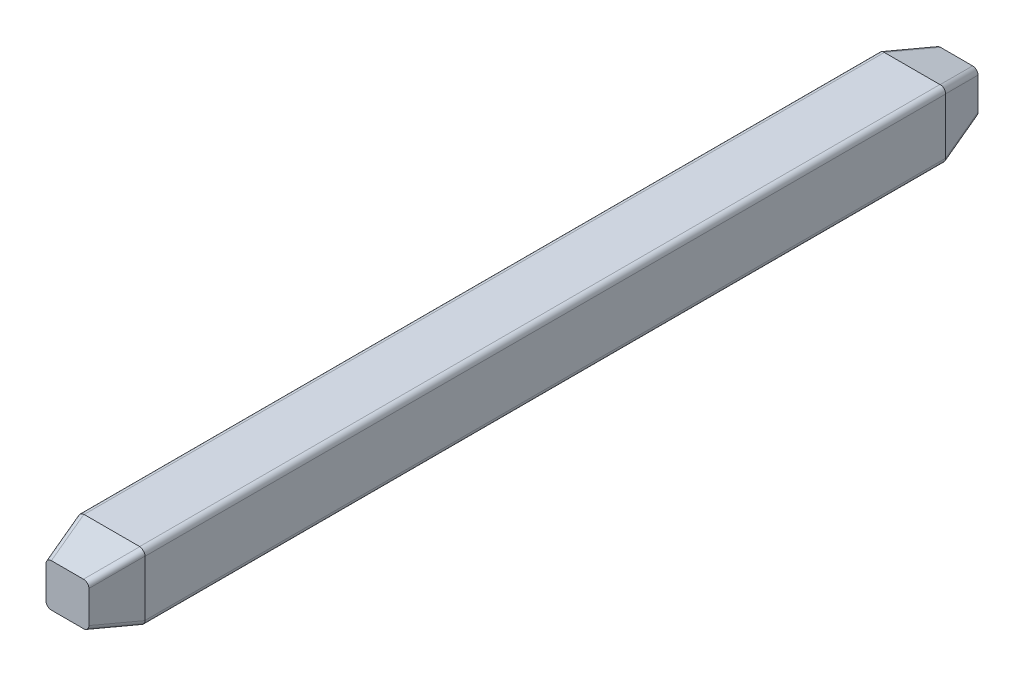
ISO-10303-21;
HEADER;
FILE_DESCRIPTION(('STEP AP214'),'2;1');
FILE_NAME('part.step','',(''),(''),'','','');
FILE_SCHEMA(('AUTOMOTIVE_DESIGN { 1 0 10303 214 1 1 1 1 }'));
ENDSEC;
DATA;
#1=APPLICATION_CONTEXT('core data for automotive mechanical design processes');
#2=APPLICATION_PROTOCOL_DEFINITION('international standard','automotive_design',2000,#1);
#3=PRODUCT_CONTEXT('',#1,'mechanical');
#4=PRODUCT('Part','Part','',(#3));
#5=PRODUCT_RELATED_PRODUCT_CATEGORY('part','',(#4));
#6=PRODUCT_DEFINITION_FORMATION('','',#4);
#7=PRODUCT_DEFINITION_CONTEXT('part definition',#1,'design');
#8=PRODUCT_DEFINITION('design','',#6,#7);
#9=PRODUCT_DEFINITION_SHAPE('','',#8);
#10=(LENGTH_UNIT() NAMED_UNIT(*) SI_UNIT(.MILLI.,.METRE.));
#11=(NAMED_UNIT(*) PLANE_ANGLE_UNIT() SI_UNIT($,.RADIAN.));
#12=(NAMED_UNIT(*) SI_UNIT($,.STERADIAN.) SOLID_ANGLE_UNIT());
#13=UNCERTAINTY_MEASURE_WITH_UNIT(LENGTH_MEASURE(1.E-05),#10,'distance_accuracy_value','');
#14=(GEOMETRIC_REPRESENTATION_CONTEXT(3) GLOBAL_UNCERTAINTY_ASSIGNED_CONTEXT((#13)) GLOBAL_UNIT_ASSIGNED_CONTEXT((#10,
#11,#12)) REPRESENTATION_CONTEXT('',''));
#15=CARTESIAN_POINT('',(0.,0.,0.));
#16=DIRECTION('',(0.,0.,1.));
#17=DIRECTION('',(1.,0.,0.));
#18=AXIS2_PLACEMENT_3D('',#15,#16,#17);
#19=CARTESIAN_POINT('',(-0.3,0.3,-3.));
#20=DIRECTION('',(-1.,0.,0.));
#21=DIRECTION('',(0.,1.,0.));
#22=AXIS2_PLACEMENT_3D('',#19,#20,#21);
#23=PLANE('',#22);
#24=DIRECTION('',(0.,1.,0.));
#25=VECTOR('',#24,1.);
#26=CARTESIAN_POINT('',(-0.300000000001,0.,4.6));
#27=LINE('',#26,#25);
#28=CARTESIAN_POINT('',(-0.3,-0.25,4.6));
#29=VERTEX_POINT('',#28);
#30=CARTESIAN_POINT('',(-0.3,0.25,4.6));
#31=VERTEX_POINT('',#30);
#32=EDGE_CURVE('E509',#29,#31,#27,.T.);
#33=ORIENTED_EDGE('',*,*,#32,.T.);
#34=DIRECTION('',(0.,0.,1.));
#35=VECTOR('',#34,1.);
#36=CARTESIAN_POINT('',(-0.3,0.25,-3.));
#37=LINE('',#36,#35);
#38=CARTESIAN_POINT('',(-0.3,0.25,-2.6));
#39=VERTEX_POINT('',#38);
#40=EDGE_CURVE('E26',#39,#31,#37,.T.);
#41=ORIENTED_EDGE('',*,*,#40,.F.);
#42=DIRECTION('',(0.,1.,0.));
#43=VECTOR('',#42,1.);
#44=CARTESIAN_POINT('',(-0.3,0.3,-2.6));
#45=LINE('',#44,#43);
#46=CARTESIAN_POINT('',(-0.3,-0.25,-2.6));
#47=VERTEX_POINT('',#46);
#48=EDGE_CURVE('E11',#47,#39,#45,.T.);
#49=ORIENTED_EDGE('',*,*,#48,.F.);
#50=DIRECTION('',(0.,0.,-1.));
#51=VECTOR('',#50,1.);
#52=CARTESIAN_POINT('',(-0.3,-0.25,-3.));
#53=LINE('',#52,#51);
#54=EDGE_CURVE('E386',#29,#47,#53,.T.);
#55=ORIENTED_EDGE('',*,*,#54,.F.);
#56=EDGE_LOOP('',(#33,#41,#49,#55));
#57=FACE_BOUND('',#56,.T.);
#58=ADVANCED_FACE('F17',(#57),#23,.T.);
#59=CARTESIAN_POINT('',(-0.3,0.3,-2.6));
#60=DIRECTION('',(-0.965925826288944,0.,-0.258819045102985));
#61=DIRECTION('',(-0.258819045102985,0.,0.965925826288944));
#62=AXIS2_PLACEMENT_3D('',#59,#60,#61);
#63=PLANE('',#62);
#64=DIRECTION('',(-0.250562807085973,0.250562807085973,0.9351131265309));
#65=VECTOR('',#64,1.);
#66=CARTESIAN_POINT('',(-0.303032124252,0.254735832938,-2.588683958234));
#67=LINE('',#66,#65);
#68=CARTESIAN_POINT('',(-0.192820323027,0.144524031713,-3.));
#69=VERTEX_POINT('',#68);
#70=CARTESIAN_POINT('',(-0.299971914966,0.251675623652,-2.600104814773));
#71=VERTEX_POINT('',#70);
#72=EDGE_CURVE('E469',#69,#71,#67,.T.);
#73=ORIENTED_EDGE('',*,*,#72,.F.);
#74=DIRECTION('',(0.,-1.,0.));
#75=VECTOR('',#74,1.);
#76=CARTESIAN_POINT('',(-0.192820323028,0.,-3.));
#77=LINE('',#76,#75);
#78=CARTESIAN_POINT('',(-0.192820323027,-0.144524031713,-3.));
#79=VERTEX_POINT('',#78);
#80=EDGE_CURVE('E460',#69,#79,#77,.T.);
#81=ORIENTED_EDGE('',*,*,#80,.T.);
#82=DIRECTION('',(0.250562807085973,0.250562807085973,-0.9351131265309));
#83=VECTOR('',#82,1.);
#84=CARTESIAN_POINT('',(-0.265363092075,-0.217066800762,-2.72926670019));
#85=LINE('',#84,#83);
#86=CARTESIAN_POINT('',(-0.299971914966,-0.251675623652,-2.600104814773));
#87=VERTEX_POINT('',#86);
#88=EDGE_CURVE('E270',#87,#79,#85,.T.);
#89=ORIENTED_EDGE('',*,*,#88,.F.);
#90=CARTESIAN_POINT('',(-0.3,-0.25,-2.6));
#91=CARTESIAN_POINT('',(-0.3,-0.250558593509,-2.6));
#92=CARTESIAN_POINT('',(-0.299990638322,-0.251117239345,-2.600034938258));
#93=CARTESIAN_POINT('',(-0.299971914966,-0.251675623652,-2.600104814773));
#94=(BOUNDED_CURVE() B_SPLINE_CURVE(3,(#90,#91,#92,#93),.UNSPECIFIED.,.F.,
.F.) B_SPLINE_CURVE_WITH_KNOTS((4,4),(0.,1.),
.UNSPECIFIED.) CURVE() GEOMETRIC_REPRESENTATION_ITEM() RATIONAL_B_SPLINE_CURVE((1.,1.,1.,1.)) REPRESENTATION_ITEM(''));
#95=EDGE_CURVE('E496',#47,#87,#94,.T.);
#96=ORIENTED_EDGE('',*,*,#95,.F.);
#97=ORIENTED_EDGE('',*,*,#48,.T.);
#98=CARTESIAN_POINT('',(-0.299971914966,0.251675623652,-2.600104814773));
#99=CARTESIAN_POINT('',(-0.299990638322,0.251117239345,-2.600034938258));
#100=CARTESIAN_POINT('',(-0.3,0.250558593509,-2.6));
#101=CARTESIAN_POINT('',(-0.3,0.25,-2.6));
#102=(BOUNDED_CURVE() B_SPLINE_CURVE(3,(#98,#99,#100,#101),.UNSPECIFIED.,.F.,
.F.) B_SPLINE_CURVE_WITH_KNOTS((4,4),(0.,1.),
.UNSPECIFIED.) CURVE() GEOMETRIC_REPRESENTATION_ITEM() RATIONAL_B_SPLINE_CURVE((1.,1.,1.,1.)) REPRESENTATION_ITEM(''));
#103=EDGE_CURVE('E43',#71,#39,#102,.T.);
#104=ORIENTED_EDGE('',*,*,#103,.F.);
#105=EDGE_LOOP('',(#73,#81,#89,#96,#97,#104));
#106=FACE_BOUND('',#105,.T.);
#107=ADVANCED_FACE('F19',(#106),#63,.T.);
#108=CARTESIAN_POINT('',(-0.25,0.25,-3.));
#109=DIRECTION('',(0.,0.,1.));
#110=DIRECTION('',(1.,0.,0.));
#111=AXIS2_PLACEMENT_3D('',#108,#109,#110);
#112=CYLINDRICAL_SURFACE('',#111,0.05);
#113=CARTESIAN_POINT('',(-0.299971914966,0.251675623652,-2.600104814773));
#114=CARTESIAN_POINT('',(-0.299041757135,0.279415604526,-2.603576211058));
#115=CARTESIAN_POINT('',(-0.279415604526,0.299041757135,-2.603576211058));
#116=CARTESIAN_POINT('',(-0.251675623652,0.299971914966,-2.600104814773));
#117=(BOUNDED_CURVE() B_SPLINE_CURVE(3,(#113,#114,#115,#116),.UNSPECIFIED.,.F.,
.F.) B_SPLINE_CURVE_WITH_KNOTS((4,4),(5.531305892891,7.035064721466),
.UNSPECIFIED.) CURVE() GEOMETRIC_REPRESENTATION_ITEM() RATIONAL_B_SPLINE_CURVE((1.,
0.820270997179,0.820270997179,1.)) REPRESENTATION_ITEM(''));
#118=CARTESIAN_POINT('',(-0.251675623652,0.299971914966,-2.600104814773));
#119=VERTEX_POINT('',#118);
#120=EDGE_CURVE('E461',#71,#119,#117,.T.);
#121=ORIENTED_EDGE('',*,*,#120,.F.);
#122=ORIENTED_EDGE('',*,*,#103,.T.);
#123=ORIENTED_EDGE('',*,*,#40,.T.);
#124=CARTESIAN_POINT('',(-0.3,0.25,4.6));
#125=CARTESIAN_POINT('',(-0.3,0.250558593509,4.6));
#126=CARTESIAN_POINT('',(-0.299990638322,0.251117239345,4.600034938258));
#127=CARTESIAN_POINT('',(-0.299971914966,0.251675623652,4.600104814773));
#128=(BOUNDED_CURVE() B_SPLINE_CURVE(3,(#124,#125,#126,#127),.UNSPECIFIED.,.F.,
.F.) B_SPLINE_CURVE_WITH_KNOTS((4,4),(0.,1.),
.UNSPECIFIED.) CURVE() GEOMETRIC_REPRESENTATION_ITEM() RATIONAL_B_SPLINE_CURVE((1.,1.,1.,1.)) REPRESENTATION_ITEM(''));
#129=CARTESIAN_POINT('',(-0.299971914966,0.251675623652,4.600104814773));
#130=VERTEX_POINT('',#129);
#131=EDGE_CURVE('E518',#31,#130,#128,.T.);
#132=ORIENTED_EDGE('',*,*,#131,.T.);
#133=CARTESIAN_POINT('',(-0.251675623652,0.299971914966,4.600104814773));
#134=CARTESIAN_POINT('',(-0.279415604526,0.299041757135,4.603576211058));
#135=CARTESIAN_POINT('',(-0.299041757135,0.279415604526,4.603576211058));
#136=CARTESIAN_POINT('',(-0.299971914966,0.251675623652,4.600104814773));
#137=(BOUNDED_CURVE() B_SPLINE_CURVE(3,(#133,#134,#135,#136),.UNSPECIFIED.,.F.,
.F.) B_SPLINE_CURVE_WITH_KNOTS((4,4),(5.531305892893,7.035064721466),
.UNSPECIFIED.) CURVE() GEOMETRIC_REPRESENTATION_ITEM() RATIONAL_B_SPLINE_CURVE((1.,
0.82027099718,0.82027099718,1.)) REPRESENTATION_ITEM(''));
#138=CARTESIAN_POINT('',(-0.251675623652,0.299971914966,4.600104814773));
#139=VERTEX_POINT('',#138);
#140=EDGE_CURVE('E470',#139,#130,#137,.T.);
#141=ORIENTED_EDGE('',*,*,#140,.F.);
#142=CARTESIAN_POINT('',(-0.251675623652,0.299971914966,4.600104814773));
#143=CARTESIAN_POINT('',(-0.251117239345,0.299990638322,4.600034938258));
#144=CARTESIAN_POINT('',(-0.250558593509,0.3,4.6));
#145=CARTESIAN_POINT('',(-0.25,0.3,4.6));
#146=(BOUNDED_CURVE() B_SPLINE_CURVE(3,(#142,#143,#144,#145),.UNSPECIFIED.,.F.,
.F.) B_SPLINE_CURVE_WITH_KNOTS((4,4),(0.,1.),
.UNSPECIFIED.) CURVE() GEOMETRIC_REPRESENTATION_ITEM() RATIONAL_B_SPLINE_CURVE((1.,1.,1.,1.)) REPRESENTATION_ITEM(''));
#147=CARTESIAN_POINT('',(-0.25,0.3,4.6));
#148=VERTEX_POINT('',#147);
#149=EDGE_CURVE('E439',#139,#148,#146,.T.);
#150=ORIENTED_EDGE('',*,*,#149,.T.);
#151=DIRECTION('',(0.,0.,1.));
#152=VECTOR('',#151,1.);
#153=CARTESIAN_POINT('',(-0.25,0.3,-3.));
#154=LINE('',#153,#152);
#155=CARTESIAN_POINT('',(-0.25,0.3,-2.6));
#156=VERTEX_POINT('',#155);
#157=EDGE_CURVE('E449',#156,#148,#154,.T.);
#158=ORIENTED_EDGE('',*,*,#157,.F.);
#159=CARTESIAN_POINT('',(-0.25,0.3,-2.6));
#160=CARTESIAN_POINT('',(-0.250558593509,0.3,-2.6));
#161=CARTESIAN_POINT('',(-0.251117239345,0.299990638322,-2.600034938258));
#162=CARTESIAN_POINT('',(-0.251675623652,0.299971914966,-2.600104814773));
#163=(BOUNDED_CURVE() B_SPLINE_CURVE(3,(#159,#160,#161,#162),.UNSPECIFIED.,.F.,
.F.) B_SPLINE_CURVE_WITH_KNOTS((4,4),(0.,1.),
.UNSPECIFIED.) CURVE() GEOMETRIC_REPRESENTATION_ITEM() RATIONAL_B_SPLINE_CURVE((1.,1.,1.,1.)) REPRESENTATION_ITEM(''));
#164=EDGE_CURVE('E430',#156,#119,#163,.T.);
#165=ORIENTED_EDGE('',*,*,#164,.T.);
#166=EDGE_LOOP('',(#121,#122,#123,#132,#141,#150,#158,#165));
#167=FACE_BOUND('',#166,.T.);
#168=ADVANCED_FACE('F667',(#167),#112,.T.);
#169=CARTESIAN_POINT('',(-0.254735832938,0.254735832938,-2.575743005979));
#170=DIRECTION('',(-0.250562807086165,0.250562807085973,0.935113126530849));
#171=DIRECTION('',(0.965925826288944,0.,0.258819045102985));
#172=AXIS2_PLACEMENT_3D('',#169,#170,#171);
#173=CYLINDRICAL_SURFACE('',#172,0.05);
#174=ORIENTED_EDGE('',*,*,#120,.T.);
#175=DIRECTION('',(-0.25056280708691,0.25056280708591,0.935113126530665));
#176=VECTOR('',#175,1.);
#177=CARTESIAN_POINT('',(-0.144524031713,0.192820323027,-3.));
#178=LINE('',#177,#176);
#179=CARTESIAN_POINT('',(-0.144524031713,0.192820323027,-3.));
#180=VERTEX_POINT('',#179);
#181=EDGE_CURVE('E423',#180,#119,#178,.T.);
#182=ORIENTED_EDGE('',*,*,#181,.F.);
#183=CARTESIAN_POINT('',(-0.144524031713,0.192820323027,-3.));
#184=CARTESIAN_POINT('',(-0.173194170418,0.192820323027,-3.));
#185=CARTESIAN_POINT('',(-0.192820323027,0.173194170418,-3.));
#186=CARTESIAN_POINT('',(-0.192820323027,0.144524031713,-3.));
#187=(BOUNDED_CURVE() B_SPLINE_CURVE(3,(#183,#184,#185,#186),.UNSPECIFIED.,.F.,
.F.) B_SPLINE_CURVE_WITH_KNOTS((4,4),(5.531305892887,7.035064721472),
.UNSPECIFIED.) CURVE() GEOMETRIC_REPRESENTATION_ITEM() RATIONAL_B_SPLINE_CURVE((1.,
0.820270997177,0.820270997177,1.)) REPRESENTATION_ITEM(''));
#188=EDGE_CURVE('E313',#180,#69,#187,.T.);
#189=ORIENTED_EDGE('',*,*,#188,.T.);
#190=ORIENTED_EDGE('',*,*,#72,.T.);
#191=EDGE_LOOP('',(#174,#182,#189,#190));
#192=FACE_BOUND('',#191,.T.);
#193=ADVANCED_FACE('F689',(#192),#173,.T.);
#194=CARTESIAN_POINT('',(-0.135450564378,0.135450564378,5.020921688839));
#195=DIRECTION('',(-0.250562807086165,0.250562807085973,-0.935113126530849));
#196=DIRECTION('',(-0.965925826288944,0.,0.258819045102985));
#197=AXIS2_PLACEMENT_3D('',#194,#195,#196);
#198=CYLINDRICAL_SURFACE('',#197,0.05);
#199=ORIENTED_EDGE('',*,*,#140,.T.);
#200=DIRECTION('',(0.25056280708591,-0.25056280708691,0.935113126530665));
#201=VECTOR('',#200,1.);
#202=CARTESIAN_POINT('',(-0.192820323028,0.144524031713,5.));
#203=LINE('',#202,#201);
#204=CARTESIAN_POINT('',(-0.192820323028,0.144524031713,5.));
#205=VERTEX_POINT('',#204);
#206=EDGE_CURVE('E515',#130,#205,#203,.T.);
#207=ORIENTED_EDGE('',*,*,#206,.T.);
#208=CARTESIAN_POINT('',(-0.144524031713,0.192820323028,5.));
#209=CARTESIAN_POINT('',(-0.173194170418,0.192820323027,5.));
#210=CARTESIAN_POINT('',(-0.192820323027,0.173194170418,5.));
#211=CARTESIAN_POINT('',(-0.192820323028,0.144524031713,5.));
#212=(BOUNDED_CURVE() B_SPLINE_CURVE(3,(#208,#209,#210,#211),.UNSPECIFIED.,.F.,
.F.) B_SPLINE_CURVE_WITH_KNOTS((4,4),(5.531305892887,7.035064721472),
.UNSPECIFIED.) CURVE() GEOMETRIC_REPRESENTATION_ITEM() RATIONAL_B_SPLINE_CURVE((1.,
0.820270997177,0.820270997177,1.)) REPRESENTATION_ITEM(''));
#213=CARTESIAN_POINT('',(-0.144524031713,0.192820323028,5.));
#214=VERTEX_POINT('',#213);
#215=EDGE_CURVE('E334',#214,#205,#212,.T.);
#216=ORIENTED_EDGE('',*,*,#215,.F.);
#217=DIRECTION('',(-0.25056280708691,0.25056280708591,-0.935113126530665));
#218=VECTOR('',#217,1.);
#219=CARTESIAN_POINT('',(-0.144524031713,0.192820323028,5.));
#220=LINE('',#219,#218);
#221=EDGE_CURVE('E448',#214,#139,#220,.T.);
#222=ORIENTED_EDGE('',*,*,#221,.T.);
#223=EDGE_LOOP('',(#199,#207,#216,#222));
#224=FACE_BOUND('',#223,.T.);
#225=ADVANCED_FACE('F662',(#224),#198,.T.);
#226=CARTESIAN_POINT('',(-0.192820323028,0.,5.));
#227=DIRECTION('',(0.965925826288944,0.,-0.258819045102985));
#228=DIRECTION('',(0.,-1.,0.));
#229=AXIS2_PLACEMENT_3D('',#226,#227,#228);
#230=PLANE('',#229);
#231=DIRECTION('',(-0.250562807085973,-0.250562807085973,-0.9351131265309));
#232=VECTOR('',#231,1.);
#233=CARTESIAN_POINT('',(-0.299971914967,-0.251675623652,4.600104814773));
#234=LINE('',#233,#232);
#235=CARTESIAN_POINT('',(-0.192820323028,-0.144524031713,5.));
#236=VERTEX_POINT('',#235);
#237=CARTESIAN_POINT('',(-0.299971914967,-0.251675623651,4.600104814774));
#238=VERTEX_POINT('',#237);
#239=EDGE_CURVE('E501',#236,#238,#234,.T.);
#240=ORIENTED_EDGE('',*,*,#239,.F.);
#241=DIRECTION('',(0.,-1.,0.));
#242=VECTOR('',#241,1.);
#243=CARTESIAN_POINT('',(-0.192820323028,0.,5.));
#244=LINE('',#243,#242);
#245=EDGE_CURVE('E411',#205,#236,#244,.T.);
#246=ORIENTED_EDGE('',*,*,#245,.F.);
#247=ORIENTED_EDGE('',*,*,#206,.F.);
#248=ORIENTED_EDGE('',*,*,#131,.F.);
#249=ORIENTED_EDGE('',*,*,#32,.F.);
#250=CARTESIAN_POINT('',(-0.299971914967,-0.251675623651,4.600104814774));
#251=CARTESIAN_POINT('',(-0.299990638322,-0.251117239345,4.600034938258));
#252=CARTESIAN_POINT('',(-0.3,-0.250558593509,4.6));
#253=CARTESIAN_POINT('',(-0.3,-0.25,4.6));
#254=(BOUNDED_CURVE() B_SPLINE_CURVE(3,(#250,#251,#252,#253),.UNSPECIFIED.,.F.,
.F.) B_SPLINE_CURVE_WITH_KNOTS((4,4),(0.,1.),
.UNSPECIFIED.) CURVE() GEOMETRIC_REPRESENTATION_ITEM() RATIONAL_B_SPLINE_CURVE((1.,1.,1.,1.)) REPRESENTATION_ITEM(''));
#255=EDGE_CURVE('E377',#238,#29,#254,.T.);
#256=ORIENTED_EDGE('',*,*,#255,.F.);
#257=EDGE_LOOP('',(#240,#246,#247,#248,#249,#256));
#258=FACE_BOUND('',#257,.T.);
#259=ADVANCED_FACE('F673',(#258),#230,.F.);
#260=CARTESIAN_POINT('',(-0.135450564378,-0.135450564378,5.020921688839));
#261=DIRECTION('',(-0.250562807086165,-0.250562807085973,-0.935113126530849));
#262=DIRECTION('',(-0.965925826288944,0.,0.258819045102985));
#263=AXIS2_PLACEMENT_3D('',#260,#261,#262);
#264=CYLINDRICAL_SURFACE('',#263,0.05);
#265=CARTESIAN_POINT('',(-0.251675623652,-0.299971914966,4.600104814773));
#266=CARTESIAN_POINT('',(-0.279415604526,-0.299041757135,4.603576211058));
#267=CARTESIAN_POINT('',(-0.299041757135,-0.279415604525,4.603576211058));
#268=CARTESIAN_POINT('',(-0.299971914967,-0.251675623651,4.600104814774));
#269=(BOUNDED_CURVE() B_SPLINE_CURVE(3,(#265,#266,#267,#268),.UNSPECIFIED.,.F.,
.F.) B_SPLINE_CURVE_WITH_KNOTS((4,4),(5.531305892893,7.035064721478),
.UNSPECIFIED.) CURVE() GEOMETRIC_REPRESENTATION_ITEM() RATIONAL_B_SPLINE_CURVE((1.,
0.820270997177,0.820270997177,1.)) REPRESENTATION_ITEM(''));
#270=CARTESIAN_POINT('',(-0.251675623652,-0.299971914966,4.600104814773));
#271=VERTEX_POINT('',#270);
#272=EDGE_CURVE('E273',#271,#238,#269,.T.);
#273=ORIENTED_EDGE('',*,*,#272,.F.);
#274=DIRECTION('',(0.25056280708691,0.25056280708591,0.935113126530665));
#275=VECTOR('',#274,1.);
#276=CARTESIAN_POINT('',(-0.251675623652,-0.299971914967,4.600104814773));
#277=LINE('',#276,#275);
#278=CARTESIAN_POINT('',(-0.144524031713,-0.192820323028,5.));
#279=VERTEX_POINT('',#278);
#280=EDGE_CURVE('E314',#271,#279,#277,.T.);
#281=ORIENTED_EDGE('',*,*,#280,.T.);
#282=CARTESIAN_POINT('',(-0.192820323028,-0.144524031713,5.));
#283=CARTESIAN_POINT('',(-0.192820323027,-0.173194170418,5.));
#284=CARTESIAN_POINT('',(-0.173194170418,-0.192820323027,5.));
#285=CARTESIAN_POINT('',(-0.144524031713,-0.192820323028,5.));
#286=(BOUNDED_CURVE() B_SPLINE_CURVE(3,(#282,#283,#284,#285),.UNSPECIFIED.,.F.,
.F.) B_SPLINE_CURVE_WITH_KNOTS((4,4),(5.531305892885,7.035064721472),
.UNSPECIFIED.) CURVE() GEOMETRIC_REPRESENTATION_ITEM() RATIONAL_B_SPLINE_CURVE((1.,
0.820270997176,0.820270997176,1.)) REPRESENTATION_ITEM(''));
#287=EDGE_CURVE('E418',#236,#279,#286,.T.);
#288=ORIENTED_EDGE('',*,*,#287,.F.);
#289=ORIENTED_EDGE('',*,*,#239,.T.);
#290=EDGE_LOOP('',(#273,#281,#288,#289));
#291=FACE_BOUND('',#290,.T.);
#292=ADVANCED_FACE('F708',(#291),#264,.T.);
#293=CARTESIAN_POINT('',(-0.25,-0.25,-3.));
#294=DIRECTION('',(0.,0.,1.));
#295=DIRECTION('',(1.,0.,0.));
#296=AXIS2_PLACEMENT_3D('',#293,#294,#295);
#297=CYLINDRICAL_SURFACE('',#296,0.05);
#298=CARTESIAN_POINT('',(-0.251675623652,-0.299971914966,-2.600104814773));
#299=CARTESIAN_POINT('',(-0.279415604526,-0.299041757135,-2.603576211058));
#300=CARTESIAN_POINT('',(-0.299041757135,-0.279415604526,-2.603576211058));
#301=CARTESIAN_POINT('',(-0.299971914966,-0.251675623652,-2.600104814773));
#302=(BOUNDED_CURVE() B_SPLINE_CURVE(3,(#298,#299,#300,#301),.UNSPECIFIED.,.F.,
.F.) B_SPLINE_CURVE_WITH_KNOTS((4,4),(5.531305892894,7.035064721465),
.UNSPECIFIED.) CURVE() GEOMETRIC_REPRESENTATION_ITEM() RATIONAL_B_SPLINE_CURVE((1.,
0.82027099718,0.82027099718,1.)) REPRESENTATION_ITEM(''));
#303=CARTESIAN_POINT('',(-0.251675623652,-0.299971914966,-2.600104814773));
#304=VERTEX_POINT('',#303);
#305=EDGE_CURVE('E274',#304,#87,#302,.T.);
#306=ORIENTED_EDGE('',*,*,#305,.F.);
#307=CARTESIAN_POINT('',(-0.251675623652,-0.299971914966,-2.600104814773));
#308=CARTESIAN_POINT('',(-0.251117239345,-0.299990638322,-2.600034938258));
#309=CARTESIAN_POINT('',(-0.250558593509,-0.3,-2.6));
#310=CARTESIAN_POINT('',(-0.25,-0.3,-2.6));
#311=(BOUNDED_CURVE() B_SPLINE_CURVE(3,(#307,#308,#309,#310),.UNSPECIFIED.,.F.,
.F.) B_SPLINE_CURVE_WITH_KNOTS((4,4),(0.,1.),
.UNSPECIFIED.) CURVE() GEOMETRIC_REPRESENTATION_ITEM() RATIONAL_B_SPLINE_CURVE((1.,1.,1.,1.)) REPRESENTATION_ITEM(''));
#312=CARTESIAN_POINT('',(-0.25,-0.3,-2.6));
#313=VERTEX_POINT('',#312);
#314=EDGE_CURVE('E348',#304,#313,#311,.T.);
#315=ORIENTED_EDGE('',*,*,#314,.T.);
#316=DIRECTION('',(0.,0.,-1.));
#317=VECTOR('',#316,1.);
#318=CARTESIAN_POINT('',(-0.25,-0.3,-3.));
#319=LINE('',#318,#317);
#320=CARTESIAN_POINT('',(-0.25,-0.3,4.6));
#321=VERTEX_POINT('',#320);
#322=EDGE_CURVE('E321',#321,#313,#319,.T.);
#323=ORIENTED_EDGE('',*,*,#322,.F.);
#324=CARTESIAN_POINT('',(-0.25,-0.3,4.6));
#325=CARTESIAN_POINT('',(-0.250558593509,-0.3,4.6));
#326=CARTESIAN_POINT('',(-0.251117239345,-0.299990638322,4.600034938258));
#327=CARTESIAN_POINT('',(-0.251675623652,-0.299971914966,4.600104814773));
#328=(BOUNDED_CURVE() B_SPLINE_CURVE(3,(#324,#325,#326,#327),.UNSPECIFIED.,.F.,
.F.) B_SPLINE_CURVE_WITH_KNOTS((4,4),(0.,1.),
.UNSPECIFIED.) CURVE() GEOMETRIC_REPRESENTATION_ITEM() RATIONAL_B_SPLINE_CURVE((1.,1.,1.,1.)) REPRESENTATION_ITEM(''));
#329=EDGE_CURVE('E295',#321,#271,#328,.T.);
#330=ORIENTED_EDGE('',*,*,#329,.T.);
#331=ORIENTED_EDGE('',*,*,#272,.T.);
#332=ORIENTED_EDGE('',*,*,#255,.T.);
#333=ORIENTED_EDGE('',*,*,#54,.T.);
#334=ORIENTED_EDGE('',*,*,#95,.T.);
#335=EDGE_LOOP('',(#306,#315,#323,#330,#331,#332,#333,#334));
#336=FACE_BOUND('',#335,.T.);
#337=ADVANCED_FACE('F702',(#336),#297,.T.);
#338=CARTESIAN_POINT('',(-0.217066800761,-0.217066800761,-2.716325747935));
#339=DIRECTION('',(-0.250562807086165,-0.250562807085973,0.935113126530849));
#340=DIRECTION('',(0.965925826288944,0.,0.258819045102985));
#341=AXIS2_PLACEMENT_3D('',#338,#339,#340);
#342=CYLINDRICAL_SURFACE('',#341,0.05);
#343=ORIENTED_EDGE('',*,*,#305,.T.);
#344=ORIENTED_EDGE('',*,*,#88,.T.);
#345=CARTESIAN_POINT('',(-0.192820323027,-0.144524031713,-3.));
#346=CARTESIAN_POINT('',(-0.192820323027,-0.173194170418,-3.));
#347=CARTESIAN_POINT('',(-0.173194170418,-0.192820323027,-3.));
#348=CARTESIAN_POINT('',(-0.144524031713,-0.192820323027,-3.));
#349=(BOUNDED_CURVE() B_SPLINE_CURVE(3,(#345,#346,#347,#348),.UNSPECIFIED.,.F.,
.F.) B_SPLINE_CURVE_WITH_KNOTS((4,4),(5.53130589289,7.035064721471),
.UNSPECIFIED.) CURVE() GEOMETRIC_REPRESENTATION_ITEM() RATIONAL_B_SPLINE_CURVE((1.,
0.820270997178,0.820270997178,1.)) REPRESENTATION_ITEM(''));
#350=CARTESIAN_POINT('',(-0.144524031713,-0.192820323027,-3.));
#351=VERTEX_POINT('',#350);
#352=EDGE_CURVE('E455',#79,#351,#349,.T.);
#353=ORIENTED_EDGE('',*,*,#352,.T.);
#354=DIRECTION('',(0.25056280708691,0.25056280708591,-0.935113126530665));
#355=VECTOR('',#354,1.);
#356=CARTESIAN_POINT('',(-0.251675623652,-0.299971914966,-2.600104814773));
#357=LINE('',#356,#355);
#358=EDGE_CURVE('E354',#304,#351,#357,.T.);
#359=ORIENTED_EDGE('',*,*,#358,.F.);
#360=EDGE_LOOP('',(#343,#344,#353,#359));
#361=FACE_BOUND('',#360,.T.);
#362=ADVANCED_FACE('F699',(#361),#342,.T.);
#363=CARTESIAN_POINT('',(0.,0.,-3.));
#364=DIRECTION('',(0.,0.,1.));
#365=DIRECTION('',(1.,0.,0.));
#366=AXIS2_PLACEMENT_3D('',#363,#364,#365);
#367=PLANE('',#366);
#368=ORIENTED_EDGE('',*,*,#352,.F.);
#369=ORIENTED_EDGE('',*,*,#80,.F.);
#370=ORIENTED_EDGE('',*,*,#188,.F.);
#371=DIRECTION('',(-1.,0.,0.));
#372=VECTOR('',#371,1.);
#373=CARTESIAN_POINT('',(-0.3,0.192820323027,-3.));
#374=LINE('',#373,#372);
#375=CARTESIAN_POINT('',(0.144524031713,0.192820323027,-3.));
#376=VERTEX_POINT('',#375);
#377=EDGE_CURVE('E400',#376,#180,#374,.T.);
#378=ORIENTED_EDGE('',*,*,#377,.F.);
#379=CARTESIAN_POINT('',(0.192820323027,0.144524031713,-3.));
#380=CARTESIAN_POINT('',(0.192820323027,0.173194170418,-3.));
#381=CARTESIAN_POINT('',(0.173194170418,0.192820323027,-3.));
#382=CARTESIAN_POINT('',(0.144524031713,0.192820323027,-3.));
#383=(BOUNDED_CURVE() B_SPLINE_CURVE(3,(#379,#380,#381,#382),.UNSPECIFIED.,.F.,
.F.) B_SPLINE_CURVE_WITH_KNOTS((4,4),(2.389713239298,3.893472067882),
.UNSPECIFIED.) CURVE() GEOMETRIC_REPRESENTATION_ITEM() RATIONAL_B_SPLINE_CURVE((1.,
0.820270997177,0.820270997177,1.)) REPRESENTATION_ITEM(''));
#384=CARTESIAN_POINT('',(0.192820323027,0.144524031713,-3.));
#385=VERTEX_POINT('',#384);
#386=EDGE_CURVE('E404',#385,#376,#383,.T.);
#387=ORIENTED_EDGE('',*,*,#386,.F.);
#388=DIRECTION('',(0.,1.,0.));
#389=VECTOR('',#388,1.);
#390=CARTESIAN_POINT('',(0.192820323027,0.3,-3.));
#391=LINE('',#390,#389);
#392=CARTESIAN_POINT('',(0.192820323027,-0.144524031713,-3.));
#393=VERTEX_POINT('',#392);
#394=EDGE_CURVE('E325',#393,#385,#391,.T.);
#395=ORIENTED_EDGE('',*,*,#394,.F.);
#396=CARTESIAN_POINT('',(0.144524031713,-0.192820323027,-3.));
#397=CARTESIAN_POINT('',(0.173194170418,-0.192820323027,-3.));
#398=CARTESIAN_POINT('',(0.192820323027,-0.173194170418,-3.));
#399=CARTESIAN_POINT('',(0.192820323027,-0.144524031713,-3.));
#400=(BOUNDED_CURVE() B_SPLINE_CURVE(3,(#396,#397,#398,#399),.UNSPECIFIED.,.F.,
.F.) B_SPLINE_CURVE_WITH_KNOTS((4,4),(2.389713239301,3.893472067882),
.UNSPECIFIED.) CURVE() GEOMETRIC_REPRESENTATION_ITEM() RATIONAL_B_SPLINE_CURVE((1.,
0.820270997178,0.820270997178,1.)) REPRESENTATION_ITEM(''));
#401=CARTESIAN_POINT('',(0.144524031713,-0.192820323027,-3.));
#402=VERTEX_POINT('',#401);
#403=EDGE_CURVE('E336',#402,#393,#400,.T.);
#404=ORIENTED_EDGE('',*,*,#403,.F.);
#405=DIRECTION('',(1.,0.,0.));
#406=VECTOR('',#405,1.);
#407=CARTESIAN_POINT('',(-0.3,-0.192820323027,-3.));
#408=LINE('',#407,#406);
#409=EDGE_CURVE('E361',#351,#402,#408,.T.);
#410=ORIENTED_EDGE('',*,*,#409,.F.);
#411=EDGE_LOOP('',(#368,#369,#370,#378,#387,#395,#404,#410));
#412=FACE_BOUND('',#411,.T.);
#413=ADVANCED_FACE('F694',(#412),#367,.F.);
#414=CARTESIAN_POINT('',(-0.3,0.3,-3.));
#415=DIRECTION('',(0.,1.,0.));
#416=DIRECTION('',(1.,0.,0.));
#417=AXIS2_PLACEMENT_3D('',#414,#415,#416);
#418=PLANE('',#417);
#419=DIRECTION('',(1.,0.,0.));
#420=VECTOR('',#419,1.);
#421=CARTESIAN_POINT('',(-0.3,0.3,-2.6));
#422=LINE('',#421,#420);
#423=CARTESIAN_POINT('',(0.25,0.3,-2.6));
#424=VERTEX_POINT('',#423);
#425=EDGE_CURVE('E431',#156,#424,#422,.T.);
#426=ORIENTED_EDGE('',*,*,#425,.F.);
#427=ORIENTED_EDGE('',*,*,#157,.T.);
#428=DIRECTION('',(1.,0.,0.));
#429=VECTOR('',#428,1.);
#430=CARTESIAN_POINT('',(0.,0.300000000001,4.6));
#431=LINE('',#430,#429);
#432=CARTESIAN_POINT('',(0.25,0.3,4.6));
#433=VERTEX_POINT('',#432);
#434=EDGE_CURVE('E438',#148,#433,#431,.T.);
#435=ORIENTED_EDGE('',*,*,#434,.T.);
#436=DIRECTION('',(0.,0.,1.));
#437=VECTOR('',#436,1.);
#438=CARTESIAN_POINT('',(0.25,0.3,-3.));
#439=LINE('',#438,#437);
#440=EDGE_CURVE('E275',#424,#433,#439,.T.);
#441=ORIENTED_EDGE('',*,*,#440,.F.);
#442=EDGE_LOOP('',(#426,#427,#435,#441));
#443=FACE_BOUND('',#442,.T.);
#444=ADVANCED_FACE('F684',(#443),#418,.T.);
#445=CARTESIAN_POINT('',(0.,0.192820323028,5.));
#446=DIRECTION('',(0.,-0.965925826288944,-0.258819045102985));
#447=DIRECTION('',(0.,0.258819045102985,-0.965925826288944));
#448=AXIS2_PLACEMENT_3D('',#445,#446,#447);
#449=PLANE('',#448);
#450=DIRECTION('',(-0.250562807085973,-0.250562807085973,0.9351131265309));
#451=VECTOR('',#450,1.);
#452=CARTESIAN_POINT('',(0.135450564378,0.183746855692,5.033862641094));
#453=LINE('',#452,#451);
#454=CARTESIAN_POINT('',(0.251675623652,0.299971914966,4.600104814773));
#455=VERTEX_POINT('',#454);
#456=CARTESIAN_POINT('',(0.144524031713,0.192820323027,5.));
#457=VERTEX_POINT('',#456);
#458=EDGE_CURVE('E335',#455,#457,#453,.T.);
#459=ORIENTED_EDGE('',*,*,#458,.F.);
#460=CARTESIAN_POINT('',(0.25,0.3,4.6));
#461=CARTESIAN_POINT('',(0.250558593509,0.3,4.6));
#462=CARTESIAN_POINT('',(0.251117239345,0.299990638322,4.600034938258));
#463=CARTESIAN_POINT('',(0.251675623652,0.299971914966,4.600104814773));
#464=(BOUNDED_CURVE() B_SPLINE_CURVE(3,(#460,#461,#462,#463),.UNSPECIFIED.,.F.,
.F.) B_SPLINE_CURVE_WITH_KNOTS((4,4),(0.,1.),
.UNSPECIFIED.) CURVE() GEOMETRIC_REPRESENTATION_ITEM() RATIONAL_B_SPLINE_CURVE((1.,1.,1.,1.)) REPRESENTATION_ITEM(''));
#465=EDGE_CURVE('E279',#433,#455,#464,.T.);
#466=ORIENTED_EDGE('',*,*,#465,.F.);
#467=ORIENTED_EDGE('',*,*,#434,.F.);
#468=ORIENTED_EDGE('',*,*,#149,.F.);
#469=ORIENTED_EDGE('',*,*,#221,.F.);
#470=DIRECTION('',(-1.,0.,0.));
#471=VECTOR('',#470,1.);
#472=CARTESIAN_POINT('',(0.,0.192820323028,5.));
#473=LINE('',#472,#471);
#474=EDGE_CURVE('E330',#457,#214,#473,.T.);
#475=ORIENTED_EDGE('',*,*,#474,.F.);
#476=EDGE_LOOP('',(#459,#466,#467,#468,#469,#475));
#477=FACE_BOUND('',#476,.T.);
#478=ADVANCED_FACE('F665',(#477),#449,.F.);
#479=CARTESIAN_POINT('',(0.217066800761,0.217066800761,-2.716325747935));
#480=DIRECTION('',(-0.250562807086165,-0.250562807085973,-0.935113126530849));
#481=DIRECTION('',(-0.965925826288944,0.,0.258819045102985));
#482=AXIS2_PLACEMENT_3D('',#479,#480,#481);
#483=CYLINDRICAL_SURFACE('',#482,0.05);
#484=CARTESIAN_POINT('',(0.299971914966,0.251675623652,-2.600104814773));
#485=CARTESIAN_POINT('',(0.299041757135,0.279415604526,-2.603576211058));
#486=CARTESIAN_POINT('',(0.279415604526,0.299041757135,-2.603576211058));
#487=CARTESIAN_POINT('',(0.251675623652,0.299971914966,-2.600104814773));
#488=(BOUNDED_CURVE() B_SPLINE_CURVE(3,(#484,#485,#486,#487),.UNSPECIFIED.,.F.,
.F.) B_SPLINE_CURVE_WITH_KNOTS((4,4),(2.389713239304,3.893472067876),
.UNSPECIFIED.) CURVE() GEOMETRIC_REPRESENTATION_ITEM() RATIONAL_B_SPLINE_CURVE((1.,
0.82027099718,0.82027099718,1.)) REPRESENTATION_ITEM(''));
#489=CARTESIAN_POINT('',(0.299971914966,0.251675623652,-2.600104814773));
#490=VERTEX_POINT('',#489);
#491=CARTESIAN_POINT('',(0.251675623652,0.299971914966,-2.600104814773));
#492=VERTEX_POINT('',#491);
#493=EDGE_CURVE('E577',#490,#492,#488,.T.);
#494=ORIENTED_EDGE('',*,*,#493,.F.);
#495=DIRECTION('',(0.25056280708591,0.25056280708691,0.935113126530665));
#496=VECTOR('',#495,1.);
#497=CARTESIAN_POINT('',(0.192820323027,0.144524031713,-3.));
#498=LINE('',#497,#496);
#499=EDGE_CURVE('E301',#385,#490,#498,.T.);
#500=ORIENTED_EDGE('',*,*,#499,.F.);
#501=ORIENTED_EDGE('',*,*,#386,.T.);
#502=DIRECTION('',(-0.25056280708691,-0.25056280708591,-0.935113126530665));
#503=VECTOR('',#502,1.);
#504=CARTESIAN_POINT('',(0.251675623652,0.299971914966,-2.600104814773));
#505=LINE('',#504,#503);
#506=EDGE_CURVE('E405',#492,#376,#505,.T.);
#507=ORIENTED_EDGE('',*,*,#506,.F.);
#508=EDGE_LOOP('',(#494,#500,#501,#507));
#509=FACE_BOUND('',#508,.T.);
#510=ADVANCED_FACE('F739',(#509),#483,.T.);
#511=CARTESIAN_POINT('',(-0.3,0.3,-2.6));
#512=DIRECTION('',(0.,0.965925826288944,-0.258819045102985));
#513=DIRECTION('',(-1.,0.,0.));
#514=AXIS2_PLACEMENT_3D('',#511,#512,#513);
#515=PLANE('',#514);
#516=ORIENTED_EDGE('',*,*,#181,.T.);
#517=ORIENTED_EDGE('',*,*,#164,.F.);
#518=ORIENTED_EDGE('',*,*,#425,.T.);
#519=CARTESIAN_POINT('',(0.251675623652,0.299971914966,-2.600104814773));
#520=CARTESIAN_POINT('',(0.251117239345,0.299990638322,-2.600034938258));
#521=CARTESIAN_POINT('',(0.250558593509,0.3,-2.6));
#522=CARTESIAN_POINT('',(0.25,0.3,-2.6));
#523=(BOUNDED_CURVE() B_SPLINE_CURVE(3,(#519,#520,#521,#522),.UNSPECIFIED.,.F.,
.F.) B_SPLINE_CURVE_WITH_KNOTS((4,4),(0.,1.),
.UNSPECIFIED.) CURVE() GEOMETRIC_REPRESENTATION_ITEM() RATIONAL_B_SPLINE_CURVE((1.,1.,1.,1.)) REPRESENTATION_ITEM(''));
#524=EDGE_CURVE('E280',#492,#424,#523,.T.);
#525=ORIENTED_EDGE('',*,*,#524,.F.);
#526=ORIENTED_EDGE('',*,*,#506,.T.);
#527=ORIENTED_EDGE('',*,*,#377,.T.);
#528=EDGE_LOOP('',(#516,#517,#518,#525,#526,#527));
#529=FACE_BOUND('',#528,.T.);
#530=ADVANCED_FACE('F687',(#529),#515,.T.);
#531=CARTESIAN_POINT('',(0.,0.,5.));
#532=DIRECTION('',(0.,0.,1.));
#533=DIRECTION('',(1.,0.,0.));
#534=AXIS2_PLACEMENT_3D('',#531,#532,#533);
#535=PLANE('',#534);
#536=DIRECTION('',(1.,0.,0.));
#537=VECTOR('',#536,1.);
#538=CARTESIAN_POINT('',(0.,-0.192820323028,5.));
#539=LINE('',#538,#537);
#540=CARTESIAN_POINT('',(0.144524031713,-0.192820323028,5.));
#541=VERTEX_POINT('',#540);
#542=EDGE_CURVE('E238',#279,#541,#539,.T.);
#543=ORIENTED_EDGE('',*,*,#542,.T.);
#544=CARTESIAN_POINT('',(0.192820323028,-0.144524031713,5.));
#545=CARTESIAN_POINT('',(0.192820323027,-0.173194170418,5.));
#546=CARTESIAN_POINT('',(0.173194170418,-0.192820323027,5.));
#547=CARTESIAN_POINT('',(0.144524031713,-0.192820323028,5.));
#548=(BOUNDED_CURVE() B_SPLINE_CURVE(3,(#544,#545,#546,#547),.UNSPECIFIED.,.F.,
.F.) B_SPLINE_CURVE_WITH_KNOTS((4,4),(2.389713239297,3.893472067882),
.UNSPECIFIED.) CURVE() GEOMETRIC_REPRESENTATION_ITEM() RATIONAL_B_SPLINE_CURVE((1.,
0.820270997177,0.820270997177,1.)) REPRESENTATION_ITEM(''));
#549=CARTESIAN_POINT('',(0.192820323028,-0.144524031713,5.));
#550=VERTEX_POINT('',#549);
#551=EDGE_CURVE('E230',#550,#541,#548,.T.);
#552=ORIENTED_EDGE('',*,*,#551,.F.);
#553=DIRECTION('',(0.,1.,0.));
#554=VECTOR('',#553,1.);
#555=CARTESIAN_POINT('',(0.192820323028,0.,5.));
#556=LINE('',#555,#554);
#557=CARTESIAN_POINT('',(0.192820323028,0.144524031713,5.));
#558=VERTEX_POINT('',#557);
#559=EDGE_CURVE('E235',#550,#558,#556,.T.);
#560=ORIENTED_EDGE('',*,*,#559,.T.);
#561=CARTESIAN_POINT('',(0.144524031713,0.192820323027,5.));
#562=CARTESIAN_POINT('',(0.173194170418,0.192820323027,5.));
#563=CARTESIAN_POINT('',(0.192820323027,0.173194170418,5.));
#564=CARTESIAN_POINT('',(0.192820323028,0.144524031713,5.));
#565=(BOUNDED_CURVE() B_SPLINE_CURVE(3,(#561,#562,#563,#564),.UNSPECIFIED.,.F.,
.F.) B_SPLINE_CURVE_WITH_KNOTS((4,4),(2.389713239299,3.893472067882),
.UNSPECIFIED.) CURVE() GEOMETRIC_REPRESENTATION_ITEM() RATIONAL_B_SPLINE_CURVE((1.,
0.820270997177,0.820270997177,1.)) REPRESENTATION_ITEM(''));
#566=EDGE_CURVE('E242',#457,#558,#565,.T.);
#567=ORIENTED_EDGE('',*,*,#566,.F.);
#568=ORIENTED_EDGE('',*,*,#474,.T.);
#569=ORIENTED_EDGE('',*,*,#215,.T.);
#570=ORIENTED_EDGE('',*,*,#245,.T.);
#571=ORIENTED_EDGE('',*,*,#287,.T.);
#572=EDGE_LOOP('',(#543,#552,#560,#567,#568,#569,#570,#571));
#573=FACE_BOUND('',#572,.T.);
#574=ADVANCED_FACE('F232',(#573),#535,.T.);
#575=CARTESIAN_POINT('',(0.135450564378,0.135450564378,5.020921688839));
#576=DIRECTION('',(-0.250562807086165,-0.250562807085973,0.935113126530849));
#577=DIRECTION('',(0.965925826288944,0.,0.258819045102985));
#578=AXIS2_PLACEMENT_3D('',#575,#576,#577);
#579=CYLINDRICAL_SURFACE('',#578,0.05);
#580=ORIENTED_EDGE('',*,*,#566,.T.);
#581=DIRECTION('',(0.25056280708591,0.25056280708691,-0.935113126530665));
#582=VECTOR('',#581,1.);
#583=CARTESIAN_POINT('',(0.299971914967,0.251675623652,4.600104814773));
#584=LINE('',#583,#582);
#585=CARTESIAN_POINT('',(0.299971914967,0.251675623652,4.600104814774));
#586=VERTEX_POINT('',#585);
#587=EDGE_CURVE('E257',#558,#586,#584,.T.);
#588=ORIENTED_EDGE('',*,*,#587,.T.);
#589=CARTESIAN_POINT('',(0.251675623652,0.299971914966,4.600104814773));
#590=CARTESIAN_POINT('',(0.279415604526,0.299041757135,4.603576211058));
#591=CARTESIAN_POINT('',(0.299041757135,0.279415604526,4.603576211058));
#592=CARTESIAN_POINT('',(0.299971914967,0.251675623652,4.600104814774));
#593=(BOUNDED_CURVE() B_SPLINE_CURVE(3,(#589,#590,#591,#592),.UNSPECIFIED.,.F.,
.F.) B_SPLINE_CURVE_WITH_KNOTS((4,4),(5.531305892893,7.03506472147),
.UNSPECIFIED.) CURVE() GEOMETRIC_REPRESENTATION_ITEM() RATIONAL_B_SPLINE_CURVE((1.,
0.820270997179,0.820270997179,1.)) REPRESENTATION_ITEM(''));
#594=EDGE_CURVE('E286',#455,#586,#593,.T.);
#595=ORIENTED_EDGE('',*,*,#594,.F.);
#596=ORIENTED_EDGE('',*,*,#458,.T.);
#597=EDGE_LOOP('',(#580,#588,#595,#596));
#598=FACE_BOUND('',#597,.T.);
#599=ADVANCED_FACE('F678',(#598),#579,.T.);
#600=CARTESIAN_POINT('',(0.135450564378,-0.135450564378,5.020921688839));
#601=DIRECTION('',(-0.250562807086165,0.250562807085973,0.935113126530849));
#602=DIRECTION('',(0.965925826288944,0.,0.258819045102985));
#603=AXIS2_PLACEMENT_3D('',#600,#601,#602);
#604=CYLINDRICAL_SURFACE('',#603,0.05);
#605=ORIENTED_EDGE('',*,*,#551,.T.);
#606=DIRECTION('',(0.25056280708691,-0.25056280708591,-0.935113126530665));
#607=VECTOR('',#606,1.);
#608=CARTESIAN_POINT('',(0.144524031713,-0.192820323028,5.));
#609=LINE('',#608,#607);
#610=CARTESIAN_POINT('',(0.251675623652,-0.299971914967,4.600104814774));
#611=VERTEX_POINT('',#610);
#612=EDGE_CURVE('E292',#541,#611,#609,.T.);
#613=ORIENTED_EDGE('',*,*,#612,.T.);
#614=CARTESIAN_POINT('',(0.299971914967,-0.251675623652,4.600104814774));
#615=CARTESIAN_POINT('',(0.299041757135,-0.279415604526,4.603576211058));
#616=CARTESIAN_POINT('',(0.279415604526,-0.299041757135,4.603576211058));
#617=CARTESIAN_POINT('',(0.251675623652,-0.299971914967,4.600104814774));
#618=(BOUNDED_CURVE() B_SPLINE_CURVE(3,(#614,#615,#616,#617),.UNSPECIFIED.,.F.,
.F.) B_SPLINE_CURVE_WITH_KNOTS((4,4),(5.53130589289,7.03506472147),
.UNSPECIFIED.) CURVE() GEOMETRIC_REPRESENTATION_ITEM() RATIONAL_B_SPLINE_CURVE((1.,
0.820270997178,0.820270997178,1.)) REPRESENTATION_ITEM(''));
#619=CARTESIAN_POINT('',(0.299971914967,-0.251675623652,4.600104814774));
#620=VERTEX_POINT('',#619);
#621=EDGE_CURVE('E248',#620,#611,#618,.T.);
#622=ORIENTED_EDGE('',*,*,#621,.F.);
#623=DIRECTION('',(-0.25056280708591,0.25056280708691,0.935113126530665));
#624=VECTOR('',#623,1.);
#625=CARTESIAN_POINT('',(0.192820323028,-0.144524031713,5.));
#626=LINE('',#625,#624);
#627=EDGE_CURVE('E245',#620,#550,#626,.T.);
#628=ORIENTED_EDGE('',*,*,#627,.T.);
#629=EDGE_LOOP('',(#605,#613,#622,#628));
#630=FACE_BOUND('',#629,.T.);
#631=ADVANCED_FACE('F246',(#630),#604,.T.);
#632=CARTESIAN_POINT('',(0.,-0.192820323028,5.));
#633=DIRECTION('',(0.,0.965925826288944,-0.258819045102985));
#634=DIRECTION('',(-1.,0.,0.));
#635=AXIS2_PLACEMENT_3D('',#632,#633,#634);
#636=PLANE('',#635);
#637=ORIENTED_EDGE('',*,*,#280,.F.);
#638=ORIENTED_EDGE('',*,*,#329,.F.);
#639=DIRECTION('',(-1.,0.,0.));
#640=VECTOR('',#639,1.);
#641=CARTESIAN_POINT('',(-0.3,-0.3,4.6));
#642=LINE('',#641,#640);
#643=CARTESIAN_POINT('',(0.25,-0.3,4.6));
#644=VERTEX_POINT('',#643);
#645=EDGE_CURVE('E364',#644,#321,#642,.T.);
#646=ORIENTED_EDGE('',*,*,#645,.F.);
#647=CARTESIAN_POINT('',(0.251675623652,-0.299971914967,4.600104814774));
#648=CARTESIAN_POINT('',(0.251117239345,-0.299990638322,4.600034938258));
#649=CARTESIAN_POINT('',(0.250558593509,-0.3,4.6));
#650=CARTESIAN_POINT('',(0.25,-0.3,4.6));
#651=(BOUNDED_CURVE() B_SPLINE_CURVE(3,(#647,#648,#649,#650),.UNSPECIFIED.,.F.,
.F.) B_SPLINE_CURVE_WITH_KNOTS((4,4),(0.,1.),
.UNSPECIFIED.) CURVE() GEOMETRIC_REPRESENTATION_ITEM() RATIONAL_B_SPLINE_CURVE((1.,1.,1.,1.)) REPRESENTATION_ITEM(''));
#652=EDGE_CURVE('E544',#611,#644,#651,.T.);
#653=ORIENTED_EDGE('',*,*,#652,.F.);
#654=ORIENTED_EDGE('',*,*,#612,.F.);
#655=ORIENTED_EDGE('',*,*,#542,.F.);
#656=EDGE_LOOP('',(#637,#638,#646,#653,#654,#655));
#657=FACE_BOUND('',#656,.T.);
#658=ADVANCED_FACE('F710',(#657),#636,.F.);
#659=CARTESIAN_POINT('',(-0.3,-0.3,-3.));
#660=DIRECTION('',(0.,-1.,0.));
#661=DIRECTION('',(0.,0.,-1.));
#662=AXIS2_PLACEMENT_3D('',#659,#660,#661);
#663=PLANE('',#662);
#664=DIRECTION('',(-1.,0.,0.));
#665=VECTOR('',#664,1.);
#666=CARTESIAN_POINT('',(-0.3,-0.3,-2.6));
#667=LINE('',#666,#665);
#668=CARTESIAN_POINT('',(0.25,-0.3,-2.6));
#669=VERTEX_POINT('',#668);
#670=EDGE_CURVE('E341',#669,#313,#667,.T.);
#671=ORIENTED_EDGE('',*,*,#670,.F.);
#672=DIRECTION('',(0.,0.,-1.));
#673=VECTOR('',#672,1.);
#674=CARTESIAN_POINT('',(0.25,-0.3,-3.));
#675=LINE('',#674,#673);
#676=EDGE_CURVE('E550',#644,#669,#675,.T.);
#677=ORIENTED_EDGE('',*,*,#676,.F.);
#678=ORIENTED_EDGE('',*,*,#645,.T.);
#679=ORIENTED_EDGE('',*,*,#322,.T.);
#680=EDGE_LOOP('',(#671,#677,#678,#679));
#681=FACE_BOUND('',#680,.T.);
#682=ADVANCED_FACE('F746',(#681),#663,.T.);
#683=CARTESIAN_POINT('',(-0.3,-0.3,-2.6));
#684=DIRECTION('',(0.,-0.965925826288944,-0.258819045102985));
#685=DIRECTION('',(0.,0.258819045102985,-0.965925826288944));
#686=AXIS2_PLACEMENT_3D('',#683,#684,#685);
#687=PLANE('',#686);
#688=DIRECTION('',(-0.250562807085973,0.250562807085973,-0.9351131265309));
#689=VECTOR('',#688,1.);
#690=CARTESIAN_POINT('',(0.217066800762,-0.265363092075,-2.72926670019));
#691=LINE('',#690,#689);
#692=CARTESIAN_POINT('',(0.251675623652,-0.299971914966,-2.600104814773));
#693=VERTEX_POINT('',#692);
#694=EDGE_CURVE('E329',#693,#402,#691,.T.);
#695=ORIENTED_EDGE('',*,*,#694,.F.);
#696=CARTESIAN_POINT('',(0.25,-0.3,-2.6));
#697=CARTESIAN_POINT('',(0.250558593509,-0.3,-2.6));
#698=CARTESIAN_POINT('',(0.251117239345,-0.299990638322,-2.600034938258));
#699=CARTESIAN_POINT('',(0.251675623652,-0.299971914966,-2.600104814773));
#700=(BOUNDED_CURVE() B_SPLINE_CURVE(3,(#696,#697,#698,#699),.UNSPECIFIED.,.F.,
.F.) B_SPLINE_CURVE_WITH_KNOTS((4,4),(0.,1.),
.UNSPECIFIED.) CURVE() GEOMETRIC_REPRESENTATION_ITEM() RATIONAL_B_SPLINE_CURVE((1.,1.,1.,1.)) REPRESENTATION_ITEM(''));
#701=EDGE_CURVE('E263',#669,#693,#700,.T.);
#702=ORIENTED_EDGE('',*,*,#701,.F.);
#703=ORIENTED_EDGE('',*,*,#670,.T.);
#704=ORIENTED_EDGE('',*,*,#314,.F.);
#705=ORIENTED_EDGE('',*,*,#358,.T.);
#706=ORIENTED_EDGE('',*,*,#409,.T.);
#707=EDGE_LOOP('',(#695,#702,#703,#704,#705,#706));
#708=FACE_BOUND('',#707,.T.);
#709=ADVANCED_FACE('F745',(#708),#687,.T.);
#710=CARTESIAN_POINT('',(0.217066800761,-0.217066800761,-2.716325747935));
#711=DIRECTION('',(-0.250562807086165,0.250562807085973,-0.935113126530849));
#712=DIRECTION('',(-0.965925826288944,0.,0.258819045102985));
#713=AXIS2_PLACEMENT_3D('',#710,#711,#712);
#714=CYLINDRICAL_SURFACE('',#713,0.05);
#715=CARTESIAN_POINT('',(0.251675623652,-0.299971914966,-2.600104814773));
#716=CARTESIAN_POINT('',(0.279415604526,-0.299041757135,-2.603576211058));
#717=CARTESIAN_POINT('',(0.299041757135,-0.279415604526,-2.603576211058));
#718=CARTESIAN_POINT('',(0.299971914966,-0.251675623652,-2.600104814773));
#719=(BOUNDED_CURVE() B_SPLINE_CURVE(3,(#715,#716,#717,#718),.UNSPECIFIED.,.F.,
.F.) B_SPLINE_CURVE_WITH_KNOTS((4,4),(2.389713239305,3.893472067876),
.UNSPECIFIED.) CURVE() GEOMETRIC_REPRESENTATION_ITEM() RATIONAL_B_SPLINE_CURVE((1.,
0.82027099718,0.82027099718,1.)) REPRESENTATION_ITEM(''));
#720=CARTESIAN_POINT('',(0.299971914966,-0.251675623652,-2.600104814773));
#721=VERTEX_POINT('',#720);
#722=EDGE_CURVE('E576',#693,#721,#719,.T.);
#723=ORIENTED_EDGE('',*,*,#722,.F.);
#724=ORIENTED_EDGE('',*,*,#694,.T.);
#725=ORIENTED_EDGE('',*,*,#403,.T.);
#726=DIRECTION('',(-0.25056280708591,0.25056280708691,-0.935113126530665));
#727=VECTOR('',#726,1.);
#728=CARTESIAN_POINT('',(0.299971914966,-0.251675623652,-2.600104814773));
#729=LINE('',#728,#727);
#730=EDGE_CURVE('E307',#721,#393,#729,.T.);
#731=ORIENTED_EDGE('',*,*,#730,.F.);
#732=EDGE_LOOP('',(#723,#724,#725,#731));
#733=FACE_BOUND('',#732,.T.);
#734=ADVANCED_FACE('F743',(#733),#714,.T.);
#735=CARTESIAN_POINT('',(0.3,0.3,-2.6));
#736=DIRECTION('',(0.965925826288944,0.,-0.258819045102985));
#737=DIRECTION('',(0.,-1.,0.));
#738=AXIS2_PLACEMENT_3D('',#735,#736,#737);
#739=PLANE('',#738);
#740=ORIENTED_EDGE('',*,*,#499,.T.);
#741=CARTESIAN_POINT('',(0.3,0.25,-2.6));
#742=CARTESIAN_POINT('',(0.3,0.250558593509,-2.6));
#743=CARTESIAN_POINT('',(0.299990638322,0.251117239345,-2.600034938258));
#744=CARTESIAN_POINT('',(0.299971914966,0.251675623652,-2.600104814773));
#745=(BOUNDED_CURVE() B_SPLINE_CURVE(3,(#741,#742,#743,#744),.UNSPECIFIED.,.F.,
.F.) B_SPLINE_CURVE_WITH_KNOTS((4,4),(0.,1.),
.UNSPECIFIED.) CURVE() GEOMETRIC_REPRESENTATION_ITEM() RATIONAL_B_SPLINE_CURVE((1.,1.,1.,1.)) REPRESENTATION_ITEM(''));
#746=CARTESIAN_POINT('',(0.3,0.25,-2.6));
#747=VERTEX_POINT('',#746);
#748=EDGE_CURVE('E300',#747,#490,#745,.T.);
#749=ORIENTED_EDGE('',*,*,#748,.F.);
#750=DIRECTION('',(0.,1.,0.));
#751=VECTOR('',#750,1.);
#752=CARTESIAN_POINT('',(0.3,0.3,-2.6));
#753=LINE('',#752,#751);
#754=CARTESIAN_POINT('',(0.3,-0.25,-2.6));
#755=VERTEX_POINT('',#754);
#756=EDGE_CURVE('E540',#755,#747,#753,.T.);
#757=ORIENTED_EDGE('',*,*,#756,.F.);
#758=CARTESIAN_POINT('',(0.299971914966,-0.251675623652,-2.600104814773));
#759=CARTESIAN_POINT('',(0.299990638322,-0.251117239345,-2.600034938258));
#760=CARTESIAN_POINT('',(0.3,-0.250558593509,-2.6));
#761=CARTESIAN_POINT('',(0.3,-0.25,-2.6));
#762=(BOUNDED_CURVE() B_SPLINE_CURVE(3,(#758,#759,#760,#761),.UNSPECIFIED.,.F.,
.F.) B_SPLINE_CURVE_WITH_KNOTS((4,4),(0.,1.),
.UNSPECIFIED.) CURVE() GEOMETRIC_REPRESENTATION_ITEM() RATIONAL_B_SPLINE_CURVE((1.,1.,1.,1.)) REPRESENTATION_ITEM(''));
#763=EDGE_CURVE('E596',#721,#755,#762,.T.);
#764=ORIENTED_EDGE('',*,*,#763,.F.);
#765=ORIENTED_EDGE('',*,*,#730,.T.);
#766=ORIENTED_EDGE('',*,*,#394,.T.);
#767=EDGE_LOOP('',(#740,#749,#757,#764,#765,#766));
#768=FACE_BOUND('',#767,.T.);
#769=ADVANCED_FACE('F734',(#768),#739,.T.);
#770=CARTESIAN_POINT('',(0.25,0.25,-3.));
#771=DIRECTION('',(0.,0.,1.));
#772=DIRECTION('',(1.,0.,0.));
#773=AXIS2_PLACEMENT_3D('',#770,#771,#772);
#774=CYLINDRICAL_SURFACE('',#773,0.05);
#775=ORIENTED_EDGE('',*,*,#493,.T.);
#776=ORIENTED_EDGE('',*,*,#524,.T.);
#777=ORIENTED_EDGE('',*,*,#440,.T.);
#778=ORIENTED_EDGE('',*,*,#465,.T.);
#779=ORIENTED_EDGE('',*,*,#594,.T.);
#780=CARTESIAN_POINT('',(0.299971914967,0.251675623652,4.600104814774));
#781=CARTESIAN_POINT('',(0.299990638322,0.251117239345,4.600034938258));
#782=CARTESIAN_POINT('',(0.3,0.250558593509,4.6));
#783=CARTESIAN_POINT('',(0.3,0.25,4.6));
#784=(BOUNDED_CURVE() B_SPLINE_CURVE(3,(#780,#781,#782,#783),.UNSPECIFIED.,.F.,
.F.) B_SPLINE_CURVE_WITH_KNOTS((4,4),(0.,1.),
.UNSPECIFIED.) CURVE() GEOMETRIC_REPRESENTATION_ITEM() RATIONAL_B_SPLINE_CURVE((1.,1.,1.,1.)) REPRESENTATION_ITEM(''));
#785=CARTESIAN_POINT('',(0.3,0.25,4.6));
#786=VERTEX_POINT('',#785);
#787=EDGE_CURVE('E252',#586,#786,#784,.T.);
#788=ORIENTED_EDGE('',*,*,#787,.T.);
#789=DIRECTION('',(0.,0.,1.));
#790=VECTOR('',#789,1.);
#791=CARTESIAN_POINT('',(0.3,0.25,-3.));
#792=LINE('',#791,#790);
#793=EDGE_CURVE('E543',#747,#786,#792,.T.);
#794=ORIENTED_EDGE('',*,*,#793,.F.);
#795=ORIENTED_EDGE('',*,*,#748,.T.);
#796=EDGE_LOOP('',(#775,#776,#777,#778,#779,#788,#794,#795));
#797=FACE_BOUND('',#796,.T.);
#798=ADVANCED_FACE('F680',(#797),#774,.T.);
#799=CARTESIAN_POINT('',(0.192820323028,0.,5.));
#800=DIRECTION('',(-0.965925826288944,0.,-0.258819045102985));
#801=DIRECTION('',(-0.258819045102985,0.,0.965925826288944));
#802=AXIS2_PLACEMENT_3D('',#799,#800,#801);
#803=PLANE('',#802);
#804=ORIENTED_EDGE('',*,*,#587,.F.);
#805=ORIENTED_EDGE('',*,*,#559,.F.);
#806=ORIENTED_EDGE('',*,*,#627,.F.);
#807=CARTESIAN_POINT('',(0.3,-0.25,4.6));
#808=CARTESIAN_POINT('',(0.3,-0.250558593509,4.6));
#809=CARTESIAN_POINT('',(0.299990638322,-0.251117239345,4.600034938258));
#810=CARTESIAN_POINT('',(0.299971914967,-0.251675623652,4.600104814774));
#811=(BOUNDED_CURVE() B_SPLINE_CURVE(3,(#807,#808,#809,#810),.UNSPECIFIED.,.F.,
.F.) B_SPLINE_CURVE_WITH_KNOTS((4,4),(0.,1.),
.UNSPECIFIED.) CURVE() GEOMETRIC_REPRESENTATION_ITEM() RATIONAL_B_SPLINE_CURVE((1.,1.,1.,1.)) REPRESENTATION_ITEM(''));
#812=CARTESIAN_POINT('',(0.3,-0.25,4.6));
#813=VERTEX_POINT('',#812);
#814=EDGE_CURVE('E612',#813,#620,#811,.T.);
#815=ORIENTED_EDGE('',*,*,#814,.F.);
#816=DIRECTION('',(0.,-1.,0.));
#817=VECTOR('',#816,1.);
#818=CARTESIAN_POINT('',(0.3,0.3,4.6));
#819=LINE('',#818,#817);
#820=EDGE_CURVE('E646',#786,#813,#819,.T.);
#821=ORIENTED_EDGE('',*,*,#820,.F.);
#822=ORIENTED_EDGE('',*,*,#787,.F.);
#823=EDGE_LOOP('',(#804,#805,#806,#815,#821,#822));
#824=FACE_BOUND('',#823,.T.);
#825=ADVANCED_FACE('F254',(#824),#803,.F.);
#826=CARTESIAN_POINT('',(0.25,-0.25,-3.));
#827=DIRECTION('',(0.,0.,1.));
#828=DIRECTION('',(1.,0.,0.));
#829=AXIS2_PLACEMENT_3D('',#826,#827,#828);
#830=CYLINDRICAL_SURFACE('',#829,0.05);
#831=ORIENTED_EDGE('',*,*,#722,.T.);
#832=ORIENTED_EDGE('',*,*,#763,.T.);
#833=DIRECTION('',(0.,0.,-1.));
#834=VECTOR('',#833,1.);
#835=CARTESIAN_POINT('',(0.3,-0.25,-3.));
#836=LINE('',#835,#834);
#837=EDGE_CURVE('E538',#813,#755,#836,.T.);
#838=ORIENTED_EDGE('',*,*,#837,.F.);
#839=ORIENTED_EDGE('',*,*,#814,.T.);
#840=ORIENTED_EDGE('',*,*,#621,.T.);
#841=ORIENTED_EDGE('',*,*,#652,.T.);
#842=ORIENTED_EDGE('',*,*,#676,.T.);
#843=ORIENTED_EDGE('',*,*,#701,.T.);
#844=EDGE_LOOP('',(#831,#832,#838,#839,#840,#841,#842,#843));
#845=FACE_BOUND('',#844,.T.);
#846=ADVANCED_FACE('F714',(#845),#830,.T.);
#847=CARTESIAN_POINT('',(0.3,0.3,-3.));
#848=DIRECTION('',(1.,0.,0.));
#849=DIRECTION('',(0.,1.,0.));
#850=AXIS2_PLACEMENT_3D('',#847,#848,#849);
#851=PLANE('',#850);
#852=ORIENTED_EDGE('',*,*,#820,.T.);
#853=ORIENTED_EDGE('',*,*,#837,.T.);
#854=ORIENTED_EDGE('',*,*,#756,.T.);
#855=ORIENTED_EDGE('',*,*,#793,.T.);
#856=EDGE_LOOP('',(#852,#853,#854,#855));
#857=FACE_BOUND('',#856,.T.);
#858=ADVANCED_FACE('F730',(#857),#851,.T.);
#859=CLOSED_SHELL('',(#58,#107,#168,#193,#225,#259,#292,#337,#362,#413,#444,#478,#510,#530,#574,
#599,#631,#658,#682,#709,#734,#769,#798,#825,#846,#858));
#860=MANIFOLD_SOLID_BREP('B1',#859);
#861=ADVANCED_BREP_SHAPE_REPRESENTATION('',(#18,#860),#14);
#862=SHAPE_DEFINITION_REPRESENTATION(#9,#861);
ENDSEC;
END-ISO-10303-21;
